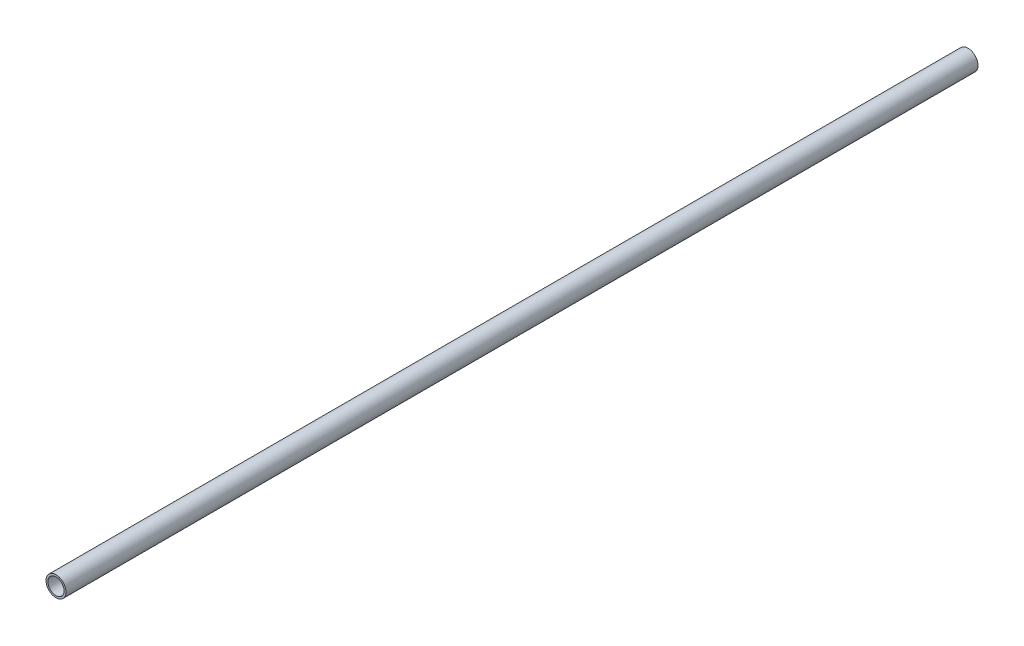
ISO-10303-21;
HEADER;
FILE_DESCRIPTION(('STEP AP214'),'2;1');
FILE_NAME('part.step','',(''),(''),'','','');
FILE_SCHEMA(('AUTOMOTIVE_DESIGN { 1 0 10303 214 1 1 1 1 }'));
ENDSEC;
DATA;
#1=APPLICATION_CONTEXT('core data for automotive mechanical design processes');
#2=APPLICATION_PROTOCOL_DEFINITION('international standard','automotive_design',2000,#1);
#3=PRODUCT_CONTEXT('',#1,'mechanical');
#4=PRODUCT('Part','Part','',(#3));
#5=PRODUCT_RELATED_PRODUCT_CATEGORY('part','',(#4));
#6=PRODUCT_DEFINITION_FORMATION('','',#4);
#7=PRODUCT_DEFINITION_CONTEXT('part definition',#1,'design');
#8=PRODUCT_DEFINITION('design','',#6,#7);
#9=PRODUCT_DEFINITION_SHAPE('','',#8);
#10=(LENGTH_UNIT() NAMED_UNIT(*) SI_UNIT(.MILLI.,.METRE.));
#11=(NAMED_UNIT(*) PLANE_ANGLE_UNIT() SI_UNIT($,.RADIAN.));
#12=(NAMED_UNIT(*) SI_UNIT($,.STERADIAN.) SOLID_ANGLE_UNIT());
#13=UNCERTAINTY_MEASURE_WITH_UNIT(LENGTH_MEASURE(1.E-05),#10,'distance_accuracy_value','');
#14=(GEOMETRIC_REPRESENTATION_CONTEXT(3) GLOBAL_UNCERTAINTY_ASSIGNED_CONTEXT((#13)) GLOBAL_UNIT_ASSIGNED_CONTEXT((#10,
#11,#12)) REPRESENTATION_CONTEXT('',''));
#15=CARTESIAN_POINT('',(0.,0.,0.));
#16=DIRECTION('',(0.,0.,1.));
#17=DIRECTION('',(1.,0.,0.));
#18=AXIS2_PLACEMENT_3D('',#15,#16,#17);
#19=CARTESIAN_POINT('',(208.749166476223,-10.65,-519.722748878547));
#20=DIRECTION('',(0.,0.,1.));
#21=DIRECTION('',(1.,0.,0.));
#22=AXIS2_PLACEMENT_3D('',#19,#20,#21);
#23=CYLINDRICAL_SURFACE('',#22,10.65);
#24=CARTESIAN_POINT('',(208.749166476223,-10.65,-4.));
#25=DIRECTION('',(0.,0.,1.));
#26=DIRECTION('',(1.,0.,0.));
#27=AXIS2_PLACEMENT_3D('',#24,#25,#26);
#28=CIRCLE('',#27,10.65);
#29=CARTESIAN_POINT('',(219.399166476223,-10.65,-4.));
#30=VERTEX_POINT('',#29);
#31=EDGE_CURVE('E10',#30,#30,#28,.T.);
#32=ORIENTED_EDGE('',*,*,#31,.F.);
#33=EDGE_LOOP('',(#32));
#34=FACE_BOUND('',#33,.T.);
#35=CARTESIAN_POINT('',(208.749166476223,-10.65,-975.2));
#36=DIRECTION('',(0.,0.,1.));
#37=DIRECTION('',(1.,0.,0.));
#38=AXIS2_PLACEMENT_3D('',#35,#36,#37);
#39=CIRCLE('',#38,10.65);
#40=CARTESIAN_POINT('',(219.399166476223,-10.65,-975.2));
#41=VERTEX_POINT('',#40);
#42=EDGE_CURVE('E41',#41,#41,#39,.T.);
#43=ORIENTED_EDGE('',*,*,#42,.T.);
#44=EDGE_LOOP('',(#43));
#45=FACE_BOUND('',#44,.T.);
#46=ADVANCED_FACE('F31',(#34,#45),#23,.T.);
#47=CARTESIAN_POINT('',(208.749166476223,-10.65,-4.));
#48=DIRECTION('',(0.,0.,1.));
#49=DIRECTION('',(1.,0.,0.));
#50=AXIS2_PLACEMENT_3D('',#47,#48,#49);
#51=PLANE('',#50);
#52=CARTESIAN_POINT('',(208.749166476223,-10.65,-4.));
#53=DIRECTION('',(0.,0.,1.));
#54=DIRECTION('',(1.,0.,0.));
#55=AXIS2_PLACEMENT_3D('',#52,#53,#54);
#56=CIRCLE('',#55,8.65);
#57=CARTESIAN_POINT('',(217.399166476223,-10.65,-4.));
#58=VERTEX_POINT('',#57);
#59=EDGE_CURVE('E37',#58,#58,#56,.T.);
#60=ORIENTED_EDGE('',*,*,#59,.F.);
#61=EDGE_LOOP('',(#60));
#62=FACE_BOUND('',#61,.T.);
#63=ORIENTED_EDGE('',*,*,#31,.T.);
#64=EDGE_LOOP('',(#63));
#65=FACE_BOUND('',#64,.T.);
#66=ADVANCED_FACE('F55',(#62,#65),#51,.T.);
#67=CARTESIAN_POINT('',(208.749166476223,-10.65,-519.722748878547));
#68=DIRECTION('',(0.,0.,1.));
#69=DIRECTION('',(1.,0.,0.));
#70=AXIS2_PLACEMENT_3D('',#67,#68,#69);
#71=CYLINDRICAL_SURFACE('',#70,8.65);
#72=ORIENTED_EDGE('',*,*,#59,.T.);
#73=EDGE_LOOP('',(#72));
#74=FACE_BOUND('',#73,.T.);
#75=CARTESIAN_POINT('',(208.749166476223,-10.65,-975.2));
#76=DIRECTION('',(0.,0.,1.));
#77=DIRECTION('',(1.,0.,0.));
#78=AXIS2_PLACEMENT_3D('',#75,#76,#77);
#79=CIRCLE('',#78,8.65);
#80=CARTESIAN_POINT('',(217.399166476223,-10.65,-975.2));
#81=VERTEX_POINT('',#80);
#82=EDGE_CURVE('E45',#81,#81,#79,.T.);
#83=ORIENTED_EDGE('',*,*,#82,.F.);
#84=EDGE_LOOP('',(#83));
#85=FACE_BOUND('',#84,.T.);
#86=ADVANCED_FACE('F53',(#74,#85),#71,.F.);
#87=CARTESIAN_POINT('',(208.749166476223,-10.65,-975.2));
#88=DIRECTION('',(0.,0.,-1.));
#89=DIRECTION('',(1.,0.,0.));
#90=AXIS2_PLACEMENT_3D('',#87,#88,#89);
#91=PLANE('',#90);
#92=ORIENTED_EDGE('',*,*,#42,.F.);
#93=EDGE_LOOP('',(#92));
#94=FACE_BOUND('',#93,.T.);
#95=ORIENTED_EDGE('',*,*,#82,.T.);
#96=EDGE_LOOP('',(#95));
#97=FACE_BOUND('',#96,.T.);
#98=ADVANCED_FACE('F51',(#94,#97),#91,.T.);
#99=CLOSED_SHELL('',(#46,#66,#86,#98));
#100=MANIFOLD_SOLID_BREP('B2',#99);
#101=ADVANCED_BREP_SHAPE_REPRESENTATION('',(#18,#100),#14);
#102=SHAPE_DEFINITION_REPRESENTATION(#9,#101);
ENDSEC;
END-ISO-10303-21;
